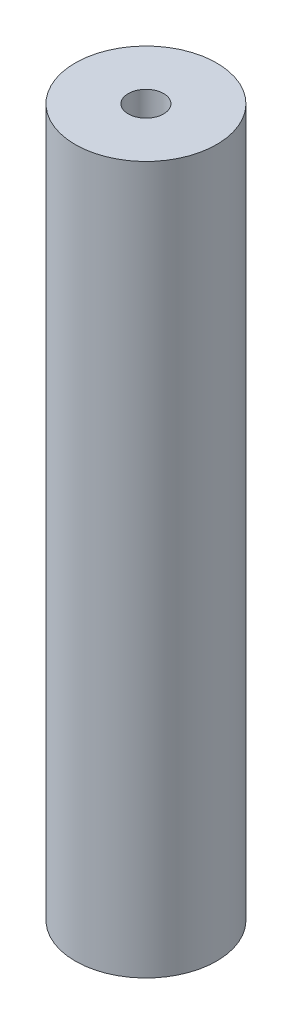
ISO-10303-21;
HEADER;
FILE_DESCRIPTION(('STEP AP214'),'2;1');
FILE_NAME('part.step','',(''),(''),'','','');
FILE_SCHEMA(('AUTOMOTIVE_DESIGN { 1 0 10303 214 1 1 1 1 }'));
ENDSEC;
DATA;
#1=APPLICATION_CONTEXT('core data for automotive mechanical design processes');
#2=APPLICATION_PROTOCOL_DEFINITION('international standard','automotive_design',2000,#1);
#3=PRODUCT_CONTEXT('',#1,'mechanical');
#4=PRODUCT('Part','Part','',(#3));
#5=PRODUCT_RELATED_PRODUCT_CATEGORY('part','',(#4));
#6=PRODUCT_DEFINITION_FORMATION('','',#4);
#7=PRODUCT_DEFINITION_CONTEXT('part definition',#1,'design');
#8=PRODUCT_DEFINITION('design','',#6,#7);
#9=PRODUCT_DEFINITION_SHAPE('','',#8);
#10=(LENGTH_UNIT() NAMED_UNIT(*) SI_UNIT(.MILLI.,.METRE.));
#11=(NAMED_UNIT(*) PLANE_ANGLE_UNIT() SI_UNIT($,.RADIAN.));
#12=(NAMED_UNIT(*) SI_UNIT($,.STERADIAN.) SOLID_ANGLE_UNIT());
#13=UNCERTAINTY_MEASURE_WITH_UNIT(LENGTH_MEASURE(1.E-05),#10,'distance_accuracy_value','');
#14=(GEOMETRIC_REPRESENTATION_CONTEXT(3) GLOBAL_UNCERTAINTY_ASSIGNED_CONTEXT((#13)) GLOBAL_UNIT_ASSIGNED_CONTEXT((#10,
#11,#12)) REPRESENTATION_CONTEXT('',''));
#15=CARTESIAN_POINT('',(0.,0.,0.));
#16=DIRECTION('',(0.,0.,1.));
#17=DIRECTION('',(1.,0.,0.));
#18=AXIS2_PLACEMENT_3D('',#15,#16,#17);
#19=CARTESIAN_POINT('',(0.,1000.,0.));
#20=DIRECTION('',(0.,-1.,0.));
#21=DIRECTION('',(0.,0.,-1.));
#22=AXIS2_PLACEMENT_3D('',#19,#20,#21);
#23=CYLINDRICAL_SURFACE('',#22,100.);
#24=CARTESIAN_POINT('',(0.,1000.,0.));
#25=DIRECTION('',(0.,1.,0.));
#26=DIRECTION('',(0.,0.,1.));
#27=AXIS2_PLACEMENT_3D('',#24,#25,#26);
#28=CIRCLE('',#27,100.);
#29=CARTESIAN_POINT('',(0.,1000.,100.));
#30=VERTEX_POINT('',#29);
#31=EDGE_CURVE('E10',#30,#30,#28,.T.);
#32=ORIENTED_EDGE('',*,*,#31,.F.);
#33=EDGE_LOOP('',(#32));
#34=FACE_BOUND('',#33,.T.);
#35=CARTESIAN_POINT('',(0.,0.,0.));
#36=DIRECTION('',(0.,1.,0.));
#37=DIRECTION('',(0.,0.,1.));
#38=AXIS2_PLACEMENT_3D('',#35,#36,#37);
#39=CIRCLE('',#38,100.);
#40=CARTESIAN_POINT('',(0.,0.,100.));
#41=VERTEX_POINT('',#40);
#42=EDGE_CURVE('E40',#41,#41,#39,.T.);
#43=ORIENTED_EDGE('',*,*,#42,.T.);
#44=EDGE_LOOP('',(#43));
#45=FACE_BOUND('',#44,.T.);
#46=ADVANCED_FACE('F37',(#34,#45),#23,.T.);
#47=CARTESIAN_POINT('',(0.,1000.,0.));
#48=DIRECTION('',(0.,1.,0.));
#49=DIRECTION('',(0.,0.,1.));
#50=AXIS2_PLACEMENT_3D('',#47,#48,#49);
#51=PLANE('',#50);
#52=CARTESIAN_POINT('',(0.,1000.,0.));
#53=DIRECTION('',(0.,1.,0.));
#54=DIRECTION('',(0.,0.,1.));
#55=AXIS2_PLACEMENT_3D('',#52,#53,#54);
#56=CIRCLE('',#55,25.);
#57=CARTESIAN_POINT('',(0.,1000.,25.));
#58=VERTEX_POINT('',#57);
#59=EDGE_CURVE('E51',#58,#58,#56,.T.);
#60=ORIENTED_EDGE('',*,*,#59,.F.);
#61=EDGE_LOOP('',(#60));
#62=FACE_BOUND('',#61,.T.);
#63=ORIENTED_EDGE('',*,*,#31,.T.);
#64=EDGE_LOOP('',(#63));
#65=FACE_BOUND('',#64,.T.);
#66=ADVANCED_FACE('F68',(#62,#65),#51,.T.);
#67=CARTESIAN_POINT('',(0.,0.,0.));
#68=DIRECTION('',(0.,1.,0.));
#69=DIRECTION('',(0.,0.,1.));
#70=AXIS2_PLACEMENT_3D('',#67,#68,#69);
#71=PLANE('',#70);
#72=ORIENTED_EDGE('',*,*,#42,.F.);
#73=EDGE_LOOP('',(#72));
#74=FACE_BOUND('',#73,.T.);
#75=ADVANCED_FACE('F64',(#74),#71,.F.);
#76=CARTESIAN_POINT('',(0.,950.,0.));
#77=DIRECTION('',(0.,1.,0.));
#78=DIRECTION('',(0.,0.,1.));
#79=AXIS2_PLACEMENT_3D('',#76,#77,#78);
#80=CYLINDRICAL_SURFACE('',#79,25.);
#81=CARTESIAN_POINT('',(0.,950.,0.));
#82=DIRECTION('',(0.,1.,0.));
#83=DIRECTION('',(0.,0.,1.));
#84=AXIS2_PLACEMENT_3D('',#81,#82,#83);
#85=CIRCLE('',#84,25.);
#86=CARTESIAN_POINT('',(0.,950.,25.));
#87=VERTEX_POINT('',#86);
#88=EDGE_CURVE('E49',#87,#87,#85,.T.);
#89=ORIENTED_EDGE('',*,*,#88,.F.);
#90=EDGE_LOOP('',(#89));
#91=FACE_BOUND('',#90,.T.);
#92=ORIENTED_EDGE('',*,*,#59,.T.);
#93=EDGE_LOOP('',(#92));
#94=FACE_BOUND('',#93,.T.);
#95=ADVANCED_FACE('F61',(#91,#94),#80,.F.);
#96=CARTESIAN_POINT('',(0.,950.,0.));
#97=DIRECTION('',(0.,1.,0.));
#98=DIRECTION('',(0.,0.,1.));
#99=AXIS2_PLACEMENT_3D('',#96,#97,#98);
#100=PLANE('',#99);
#101=ORIENTED_EDGE('',*,*,#88,.T.);
#102=EDGE_LOOP('',(#101));
#103=FACE_BOUND('',#102,.T.);
#104=ADVANCED_FACE('F59',(#103),#100,.T.);
#105=CLOSED_SHELL('',(#46,#66,#75,#95,#104));
#106=MANIFOLD_SOLID_BREP('B2',#105);
#107=ADVANCED_BREP_SHAPE_REPRESENTATION('',(#18,#106),#14);
#108=SHAPE_DEFINITION_REPRESENTATION(#9,#107);
ENDSEC;
END-ISO-10303-21;
